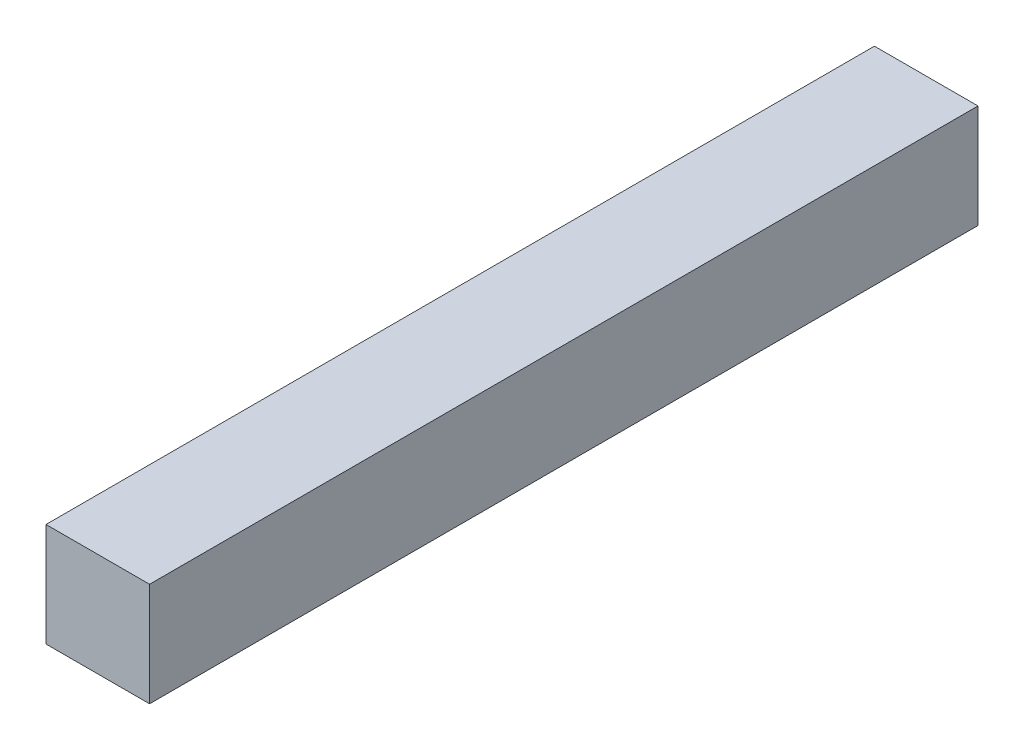
ISO-10303-21;
HEADER;
FILE_DESCRIPTION(('STEP AP214'),'2;1');
FILE_NAME('part.step','',(''),(''),'','','');
FILE_SCHEMA(('AUTOMOTIVE_DESIGN { 1 0 10303 214 1 1 1 1 }'));
ENDSEC;
DATA;
#1=APPLICATION_CONTEXT('core data for automotive mechanical design processes');
#2=APPLICATION_PROTOCOL_DEFINITION('international standard','automotive_design',2000,#1);
#3=PRODUCT_CONTEXT('',#1,'mechanical');
#4=PRODUCT('Part','Part','',(#3));
#5=PRODUCT_RELATED_PRODUCT_CATEGORY('part','',(#4));
#6=PRODUCT_DEFINITION_FORMATION('','',#4);
#7=PRODUCT_DEFINITION_CONTEXT('part definition',#1,'design');
#8=PRODUCT_DEFINITION('design','',#6,#7);
#9=PRODUCT_DEFINITION_SHAPE('','',#8);
#10=(LENGTH_UNIT() NAMED_UNIT(*) SI_UNIT(.MILLI.,.METRE.));
#11=(NAMED_UNIT(*) PLANE_ANGLE_UNIT() SI_UNIT($,.RADIAN.));
#12=(NAMED_UNIT(*) SI_UNIT($,.STERADIAN.) SOLID_ANGLE_UNIT());
#13=UNCERTAINTY_MEASURE_WITH_UNIT(LENGTH_MEASURE(1.E-05),#10,'distance_accuracy_value','');
#14=(GEOMETRIC_REPRESENTATION_CONTEXT(3) GLOBAL_UNCERTAINTY_ASSIGNED_CONTEXT((#13)) GLOBAL_UNIT_ASSIGNED_CONTEXT((#10,
#11,#12)) REPRESENTATION_CONTEXT('',''));
#15=CARTESIAN_POINT('',(0.,0.,0.));
#16=DIRECTION('',(0.,0.,1.));
#17=DIRECTION('',(1.,0.,0.));
#18=AXIS2_PLACEMENT_3D('',#15,#16,#17);
#19=CARTESIAN_POINT('',(5.,-5.,80.));
#20=DIRECTION('',(-1.,0.,0.));
#21=DIRECTION('',(0.,0.,1.));
#22=AXIS2_PLACEMENT_3D('',#19,#20,#21);
#23=PLANE('',#22);
#24=DIRECTION('',(0.,1.,0.));
#25=VECTOR('',#24,1.);
#26=CARTESIAN_POINT('',(5.,-5.,0.));
#27=LINE('',#26,#25);
#28=CARTESIAN_POINT('',(5.,-5.,0.));
#29=VERTEX_POINT('',#28);
#30=CARTESIAN_POINT('',(5.,5.,0.));
#31=VERTEX_POINT('',#30);
#32=EDGE_CURVE('E94',#29,#31,#27,.T.);
#33=ORIENTED_EDGE('',*,*,#32,.T.);
#34=DIRECTION('',(0.,0.,-1.));
#35=VECTOR('',#34,1.);
#36=CARTESIAN_POINT('',(5.,5.,80.));
#37=LINE('',#36,#35);
#38=CARTESIAN_POINT('',(5.,5.,80.));
#39=VERTEX_POINT('',#38);
#40=EDGE_CURVE('E11',#39,#31,#37,.T.);
#41=ORIENTED_EDGE('',*,*,#40,.F.);
#42=DIRECTION('',(0.,1.,0.));
#43=VECTOR('',#42,1.);
#44=CARTESIAN_POINT('',(5.,-5.,80.));
#45=LINE('',#44,#43);
#46=CARTESIAN_POINT('',(5.,-5.,80.));
#47=VERTEX_POINT('',#46);
#48=EDGE_CURVE('E82',#47,#39,#45,.T.);
#49=ORIENTED_EDGE('',*,*,#48,.F.);
#50=DIRECTION('',(0.,0.,-1.));
#51=VECTOR('',#50,1.);
#52=CARTESIAN_POINT('',(5.,-5.,80.));
#53=LINE('',#52,#51);
#54=EDGE_CURVE('E90',#47,#29,#53,.T.);
#55=ORIENTED_EDGE('',*,*,#54,.T.);
#56=EDGE_LOOP('',(#33,#41,#49,#55));
#57=FACE_BOUND('',#56,.T.);
#58=ADVANCED_FACE('F31',(#57),#23,.F.);
#59=CARTESIAN_POINT('',(-5.,5.,80.));
#60=DIRECTION('',(0.,-1.,0.));
#61=DIRECTION('',(0.,0.,-1.));
#62=AXIS2_PLACEMENT_3D('',#59,#60,#61);
#63=PLANE('',#62);
#64=DIRECTION('',(-1.,0.,0.));
#65=VECTOR('',#64,1.);
#66=CARTESIAN_POINT('',(-5.,5.,0.));
#67=LINE('',#66,#65);
#68=CARTESIAN_POINT('',(-5.,5.,0.));
#69=VERTEX_POINT('',#68);
#70=EDGE_CURVE('E86',#31,#69,#67,.T.);
#71=ORIENTED_EDGE('',*,*,#70,.T.);
#72=DIRECTION('',(0.,0.,-1.));
#73=VECTOR('',#72,1.);
#74=CARTESIAN_POINT('',(-5.,5.,80.));
#75=LINE('',#74,#73);
#76=CARTESIAN_POINT('',(-5.,5.,80.));
#77=VERTEX_POINT('',#76);
#78=EDGE_CURVE('E39',#77,#69,#75,.T.);
#79=ORIENTED_EDGE('',*,*,#78,.F.);
#80=DIRECTION('',(-1.,0.,0.));
#81=VECTOR('',#80,1.);
#82=CARTESIAN_POINT('',(-5.,5.,80.));
#83=LINE('',#82,#81);
#84=EDGE_CURVE('E77',#39,#77,#83,.T.);
#85=ORIENTED_EDGE('',*,*,#84,.F.);
#86=ORIENTED_EDGE('',*,*,#40,.T.);
#87=EDGE_LOOP('',(#71,#79,#85,#86));
#88=FACE_BOUND('',#87,.T.);
#89=ADVANCED_FACE('F85',(#88),#63,.F.);
#90=CARTESIAN_POINT('',(-5.,-5.,80.));
#91=DIRECTION('',(1.,0.,0.));
#92=DIRECTION('',(0.,0.,-1.));
#93=AXIS2_PLACEMENT_3D('',#90,#91,#92);
#94=PLANE('',#93);
#95=DIRECTION('',(0.,-1.,0.));
#96=VECTOR('',#95,1.);
#97=CARTESIAN_POINT('',(-5.,-5.,0.));
#98=LINE('',#97,#96);
#99=CARTESIAN_POINT('',(-5.,-5.,0.));
#100=VERTEX_POINT('',#99);
#101=EDGE_CURVE('E64',#69,#100,#98,.T.);
#102=ORIENTED_EDGE('',*,*,#101,.T.);
#103=DIRECTION('',(0.,0.,-1.));
#104=VECTOR('',#103,1.);
#105=CARTESIAN_POINT('',(-5.,-5.,80.));
#106=LINE('',#105,#104);
#107=CARTESIAN_POINT('',(-5.,-5.,80.));
#108=VERTEX_POINT('',#107);
#109=EDGE_CURVE('E87',#108,#100,#106,.T.);
#110=ORIENTED_EDGE('',*,*,#109,.F.);
#111=DIRECTION('',(0.,-1.,0.));
#112=VECTOR('',#111,1.);
#113=CARTESIAN_POINT('',(-5.,-5.,80.));
#114=LINE('',#113,#112);
#115=EDGE_CURVE('E80',#77,#108,#114,.T.);
#116=ORIENTED_EDGE('',*,*,#115,.F.);
#117=ORIENTED_EDGE('',*,*,#78,.T.);
#118=EDGE_LOOP('',(#102,#110,#116,#117));
#119=FACE_BOUND('',#118,.T.);
#120=ADVANCED_FACE('F88',(#119),#94,.F.);
#121=CARTESIAN_POINT('',(-5.,-5.,80.));
#122=DIRECTION('',(0.,1.,0.));
#123=DIRECTION('',(0.,0.,1.));
#124=AXIS2_PLACEMENT_3D('',#121,#122,#123);
#125=PLANE('',#124);
#126=DIRECTION('',(1.,0.,0.));
#127=VECTOR('',#126,1.);
#128=CARTESIAN_POINT('',(-5.,-5.,0.));
#129=LINE('',#128,#127);
#130=EDGE_CURVE('E70',#100,#29,#129,.T.);
#131=ORIENTED_EDGE('',*,*,#130,.T.);
#132=ORIENTED_EDGE('',*,*,#54,.F.);
#133=DIRECTION('',(1.,0.,0.));
#134=VECTOR('',#133,1.);
#135=CARTESIAN_POINT('',(-5.,-5.,80.));
#136=LINE('',#135,#134);
#137=EDGE_CURVE('E47',#108,#47,#136,.T.);
#138=ORIENTED_EDGE('',*,*,#137,.F.);
#139=ORIENTED_EDGE('',*,*,#109,.T.);
#140=EDGE_LOOP('',(#131,#132,#138,#139));
#141=FACE_BOUND('',#140,.T.);
#142=ADVANCED_FACE('F101',(#141),#125,.F.);
#143=CARTESIAN_POINT('',(5.,5.,80.));
#144=DIRECTION('',(0.,0.,-1.));
#145=DIRECTION('',(-1.,0.,0.));
#146=AXIS2_PLACEMENT_3D('',#143,#144,#145);
#147=PLANE('',#146);
#148=ORIENTED_EDGE('',*,*,#48,.T.);
#149=ORIENTED_EDGE('',*,*,#84,.T.);
#150=ORIENTED_EDGE('',*,*,#115,.T.);
#151=ORIENTED_EDGE('',*,*,#137,.T.);
#152=EDGE_LOOP('',(#148,#149,#150,#151));
#153=FACE_BOUND('',#152,.T.);
#154=ADVANCED_FACE('F78',(#153),#147,.F.);
#155=CARTESIAN_POINT('',(5.,5.,0.));
#156=DIRECTION('',(0.,0.,-1.));
#157=DIRECTION('',(-1.,0.,0.));
#158=AXIS2_PLACEMENT_3D('',#155,#156,#157);
#159=PLANE('',#158);
#160=ORIENTED_EDGE('',*,*,#32,.F.);
#161=ORIENTED_EDGE('',*,*,#130,.F.);
#162=ORIENTED_EDGE('',*,*,#101,.F.);
#163=ORIENTED_EDGE('',*,*,#70,.F.);
#164=EDGE_LOOP('',(#160,#161,#162,#163));
#165=FACE_BOUND('',#164,.T.);
#166=ADVANCED_FACE('F104',(#165),#159,.T.);
#167=CLOSED_SHELL('',(#58,#89,#120,#142,#154,#166));
#168=MANIFOLD_SOLID_BREP('B2',#167);
#169=ADVANCED_BREP_SHAPE_REPRESENTATION('',(#18,#168),#14);
#170=SHAPE_DEFINITION_REPRESENTATION(#9,#169);
ENDSEC;
END-ISO-10303-21;
